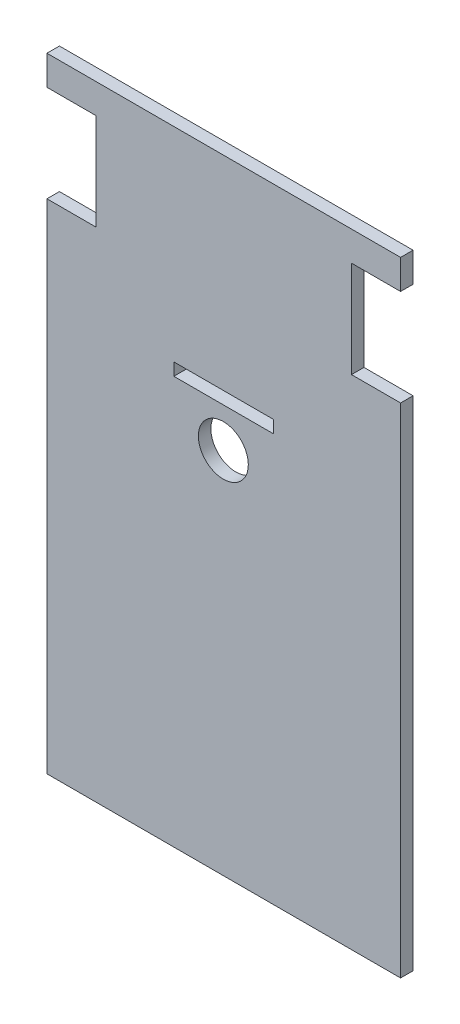
ISO-10303-21;
HEADER;
FILE_DESCRIPTION(('STEP AP214'),'2;1');
FILE_NAME('part.step','',(''),(''),'','','');
FILE_SCHEMA(('AUTOMOTIVE_DESIGN { 1 0 10303 214 1 1 1 1 }'));
ENDSEC;
DATA;
#1=APPLICATION_CONTEXT('core data for automotive mechanical design processes');
#2=APPLICATION_PROTOCOL_DEFINITION('international standard','automotive_design',2000,#1);
#3=PRODUCT_CONTEXT('',#1,'mechanical');
#4=PRODUCT('Part','Part','',(#3));
#5=PRODUCT_RELATED_PRODUCT_CATEGORY('part','',(#4));
#6=PRODUCT_DEFINITION_FORMATION('','',#4);
#7=PRODUCT_DEFINITION_CONTEXT('part definition',#1,'design');
#8=PRODUCT_DEFINITION('design','',#6,#7);
#9=PRODUCT_DEFINITION_SHAPE('','',#8);
#10=(LENGTH_UNIT() NAMED_UNIT(*) SI_UNIT(.MILLI.,.METRE.));
#11=(NAMED_UNIT(*) PLANE_ANGLE_UNIT() SI_UNIT($,.RADIAN.));
#12=(NAMED_UNIT(*) SI_UNIT($,.STERADIAN.) SOLID_ANGLE_UNIT());
#13=UNCERTAINTY_MEASURE_WITH_UNIT(LENGTH_MEASURE(1.E-05),#10,'distance_accuracy_value','');
#14=(GEOMETRIC_REPRESENTATION_CONTEXT(3) GLOBAL_UNCERTAINTY_ASSIGNED_CONTEXT((#13)) GLOBAL_UNIT_ASSIGNED_CONTEXT((#10,
#11,#12)) REPRESENTATION_CONTEXT('',''));
#15=CARTESIAN_POINT('',(0.,0.,0.));
#16=DIRECTION('',(0.,0.,1.));
#17=DIRECTION('',(1.,0.,0.));
#18=AXIS2_PLACEMENT_3D('',#15,#16,#17);
#19=CARTESIAN_POINT('',(0.,0.,3.));
#20=DIRECTION('',(0.,0.,1.));
#21=DIRECTION('',(1.,0.,0.));
#22=AXIS2_PLACEMENT_3D('',#19,#20,#21);
#23=PLANE('',#22);
#24=DIRECTION('',(-1.,0.,0.));
#25=VECTOR('',#24,1.);
#26=CARTESIAN_POINT('',(101.40298835968,92.60031120384,3.));
#27=LINE('',#26,#25);
#28=CARTESIAN_POINT('',(101.40298835968,92.60031120384,3.));
#29=VERTEX_POINT('',#28);
#30=CARTESIAN_POINT('',(16.4029883596799,92.60031120384,3.));
#31=VERTEX_POINT('',#30);
#32=EDGE_CURVE('E188',#29,#31,#27,.T.);
#33=ORIENTED_EDGE('',*,*,#32,.T.);
#34=DIRECTION('',(0.,-1.,0.));
#35=VECTOR('',#34,1.);
#36=CARTESIAN_POINT('',(16.4029883596799,92.60031120384,3.));
#37=LINE('',#36,#35);
#38=CARTESIAN_POINT('',(16.4029883596799,85.50031120384,3.));
#39=VERTEX_POINT('',#38);
#40=EDGE_CURVE('E191',#31,#39,#37,.T.);
#41=ORIENTED_EDGE('',*,*,#40,.T.);
#42=DIRECTION('',(1.,0.,0.));
#43=VECTOR('',#42,1.);
#44=CARTESIAN_POINT('',(16.4029883596799,85.50031120384,3.));
#45=LINE('',#44,#43);
#46=CARTESIAN_POINT('',(28.2029883596799,85.50031120384,3.));
#47=VERTEX_POINT('',#46);
#48=EDGE_CURVE('E194',#39,#47,#45,.T.);
#49=ORIENTED_EDGE('',*,*,#48,.T.);
#50=DIRECTION('',(0.,-1.,0.));
#51=VECTOR('',#50,1.);
#52=CARTESIAN_POINT('',(28.2029883596799,85.50031120384,3.));
#53=LINE('',#52,#51);
#54=CARTESIAN_POINT('',(28.2029883596799,62.30031120384,3.));
#55=VERTEX_POINT('',#54);
#56=EDGE_CURVE('E196',#47,#55,#53,.T.);
#57=ORIENTED_EDGE('',*,*,#56,.T.);
#58=DIRECTION('',(-1.,0.,0.));
#59=VECTOR('',#58,1.);
#60=CARTESIAN_POINT('',(28.2029883596799,62.30031120384,3.));
#61=LINE('',#60,#59);
#62=CARTESIAN_POINT('',(16.4029883596799,62.30031120384,3.));
#63=VERTEX_POINT('',#62);
#64=EDGE_CURVE('E198',#55,#63,#61,.T.);
#65=ORIENTED_EDGE('',*,*,#64,.T.);
#66=DIRECTION('',(0.,-1.,0.));
#67=VECTOR('',#66,1.);
#68=CARTESIAN_POINT('',(16.4029883596799,62.30031120384,3.));
#69=LINE('',#68,#67);
#70=CARTESIAN_POINT('',(16.4029883596799,-57.39968879616,3.));
#71=VERTEX_POINT('',#70);
#72=EDGE_CURVE('E200',#63,#71,#69,.T.);
#73=ORIENTED_EDGE('',*,*,#72,.T.);
#74=DIRECTION('',(1.,0.,0.));
#75=VECTOR('',#74,1.);
#76=CARTESIAN_POINT('',(16.4029883596799,-57.39968879616,3.));
#77=LINE('',#76,#75);
#78=CARTESIAN_POINT('',(101.40298835968,-57.39968879616,3.));
#79=VERTEX_POINT('',#78);
#80=EDGE_CURVE('E202',#71,#79,#77,.T.);
#81=ORIENTED_EDGE('',*,*,#80,.T.);
#82=DIRECTION('',(0.,1.,0.));
#83=VECTOR('',#82,1.);
#84=CARTESIAN_POINT('',(101.40298835968,-57.39968879616,3.));
#85=LINE('',#84,#83);
#86=CARTESIAN_POINT('',(101.40298835968,62.30031120384,3.));
#87=VERTEX_POINT('',#86);
#88=EDGE_CURVE('E204',#79,#87,#85,.T.);
#89=ORIENTED_EDGE('',*,*,#88,.T.);
#90=DIRECTION('',(-1.,0.,0.));
#91=VECTOR('',#90,1.);
#92=CARTESIAN_POINT('',(101.40298835968,62.30031120384,3.));
#93=LINE('',#92,#91);
#94=CARTESIAN_POINT('',(89.6029883596799,62.30031120384,3.));
#95=VERTEX_POINT('',#94);
#96=EDGE_CURVE('E206',#87,#95,#93,.T.);
#97=ORIENTED_EDGE('',*,*,#96,.T.);
#98=DIRECTION('',(0.,1.,0.));
#99=VECTOR('',#98,1.);
#100=CARTESIAN_POINT('',(89.6029883596799,62.30031120384,3.));
#101=LINE('',#100,#99);
#102=CARTESIAN_POINT('',(89.6029883596799,85.50031120384,3.));
#103=VERTEX_POINT('',#102);
#104=EDGE_CURVE('E208',#95,#103,#101,.T.);
#105=ORIENTED_EDGE('',*,*,#104,.T.);
#106=DIRECTION('',(1.,0.,0.));
#107=VECTOR('',#106,1.);
#108=CARTESIAN_POINT('',(89.6029883596799,85.50031120384,3.));
#109=LINE('',#108,#107);
#110=CARTESIAN_POINT('',(101.40298835968,85.5003112038398,3.));
#111=VERTEX_POINT('',#110);
#112=EDGE_CURVE('E210',#103,#111,#109,.T.);
#113=ORIENTED_EDGE('',*,*,#112,.T.);
#114=DIRECTION('',(0.,1.,0.));
#115=VECTOR('',#114,1.);
#116=CARTESIAN_POINT('',(101.40298835968,85.5003112038398,3.));
#117=LINE('',#116,#115);
#118=EDGE_CURVE('E212',#111,#29,#117,.T.);
#119=ORIENTED_EDGE('',*,*,#118,.T.);
#120=EDGE_LOOP('',(#33,#41,#49,#57,#65,#73,#81,#89,#97,#105,#113,#119));
#121=FACE_BOUND('',#120,.T.);
#122=CARTESIAN_POINT('',(58.8022925927055,31.129874196023,3.));
#123=DIRECTION('',(0.,0.,1.));
#124=DIRECTION('',(1.,0.,0.));
#125=AXIS2_PLACEMENT_3D('',#122,#123,#124);
#126=CIRCLE('',#125,6.00000000000001);
#127=CARTESIAN_POINT('',(64.8022925927055,31.129874196023,3.));
#128=VERTEX_POINT('',#127);
#129=EDGE_CURVE('E182',#128,#128,#126,.T.);
#130=ORIENTED_EDGE('',*,*,#129,.F.);
#131=EDGE_LOOP('',(#130));
#132=FACE_BOUND('',#131,.T.);
#133=DIRECTION('',(0.,1.,0.));
#134=VECTOR('',#133,1.);
#135=CARTESIAN_POINT('',(70.9029883596799,40.60031120384,3.));
#136=LINE('',#135,#134);
#137=CARTESIAN_POINT('',(70.9029883596799,40.60031120384,3.));
#138=VERTEX_POINT('',#137);
#139=CARTESIAN_POINT('',(70.9029883596799,43.60031120384,3.));
#140=VERTEX_POINT('',#139);
#141=EDGE_CURVE('E154',#138,#140,#136,.T.);
#142=ORIENTED_EDGE('',*,*,#141,.F.);
#143=DIRECTION('',(1.,0.,0.));
#144=VECTOR('',#143,1.);
#145=CARTESIAN_POINT('',(46.9029883596799,40.60031120384,3.));
#146=LINE('',#145,#144);
#147=CARTESIAN_POINT('',(46.9029883596799,40.60031120384,3.));
#148=VERTEX_POINT('',#147);
#149=EDGE_CURVE('E146',#148,#138,#146,.T.);
#150=ORIENTED_EDGE('',*,*,#149,.F.);
#151=DIRECTION('',(0.,-1.,0.));
#152=VECTOR('',#151,1.);
#153=CARTESIAN_POINT('',(46.9029883596799,43.60031120384,3.));
#154=LINE('',#153,#152);
#155=CARTESIAN_POINT('',(46.9029883596799,43.60031120384,3.));
#156=VERTEX_POINT('',#155);
#157=EDGE_CURVE('E168',#156,#148,#154,.T.);
#158=ORIENTED_EDGE('',*,*,#157,.F.);
#159=DIRECTION('',(-1.,0.,0.));
#160=VECTOR('',#159,1.);
#161=CARTESIAN_POINT('',(70.9029883596799,43.60031120384,3.));
#162=LINE('',#161,#160);
#163=EDGE_CURVE('E166',#140,#156,#162,.T.);
#164=ORIENTED_EDGE('',*,*,#163,.F.);
#165=EDGE_LOOP('',(#142,#150,#158,#164));
#166=FACE_BOUND('',#165,.T.);
#167=ADVANCED_FACE('F33',(#121,#132,#166),#23,.T.);
#168=CARTESIAN_POINT('',(0.,0.,0.));
#169=DIRECTION('',(0.,0.,1.));
#170=DIRECTION('',(1.,0.,0.));
#171=AXIS2_PLACEMENT_3D('',#168,#169,#170);
#172=PLANE('',#171);
#173=CARTESIAN_POINT('',(58.8022925927055,31.129874196023,0.));
#174=DIRECTION('',(0.,0.,1.));
#175=DIRECTION('',(1.,0.,0.));
#176=AXIS2_PLACEMENT_3D('',#173,#174,#175);
#177=CIRCLE('',#176,6.00000000000001);
#178=CARTESIAN_POINT('',(64.8022925927055,31.129874196023,0.));
#179=VERTEX_POINT('',#178);
#180=EDGE_CURVE('E162',#179,#179,#177,.T.);
#181=ORIENTED_EDGE('',*,*,#180,.T.);
#182=EDGE_LOOP('',(#181));
#183=FACE_BOUND('',#182,.T.);
#184=DIRECTION('',(-1.,0.,0.));
#185=VECTOR('',#184,1.);
#186=CARTESIAN_POINT('',(101.40298835968,92.60031120384,0.));
#187=LINE('',#186,#185);
#188=CARTESIAN_POINT('',(101.40298835968,92.60031120384,0.));
#189=VERTEX_POINT('',#188);
#190=CARTESIAN_POINT('',(16.4029883596799,92.60031120384,0.));
#191=VERTEX_POINT('',#190);
#192=EDGE_CURVE('E185',#189,#191,#187,.T.);
#193=ORIENTED_EDGE('',*,*,#192,.F.);
#194=DIRECTION('',(0.,1.,0.));
#195=VECTOR('',#194,1.);
#196=CARTESIAN_POINT('',(101.40298835968,85.5003112038398,0.));
#197=LINE('',#196,#195);
#198=CARTESIAN_POINT('',(101.40298835968,85.5003112038398,0.));
#199=VERTEX_POINT('',#198);
#200=EDGE_CURVE('E192',#199,#189,#197,.T.);
#201=ORIENTED_EDGE('',*,*,#200,.F.);
#202=DIRECTION('',(1.,0.,0.));
#203=VECTOR('',#202,1.);
#204=CARTESIAN_POINT('',(89.6029883596799,85.50031120384,0.));
#205=LINE('',#204,#203);
#206=CARTESIAN_POINT('',(89.6029883596799,85.50031120384,0.));
#207=VERTEX_POINT('',#206);
#208=EDGE_CURVE('E235',#207,#199,#205,.T.);
#209=ORIENTED_EDGE('',*,*,#208,.F.);
#210=DIRECTION('',(0.,1.,0.));
#211=VECTOR('',#210,1.);
#212=CARTESIAN_POINT('',(89.6029883596799,62.30031120384,0.));
#213=LINE('',#212,#211);
#214=CARTESIAN_POINT('',(89.6029883596799,62.30031120384,0.));
#215=VERTEX_POINT('',#214);
#216=EDGE_CURVE('E233',#215,#207,#213,.T.);
#217=ORIENTED_EDGE('',*,*,#216,.F.);
#218=DIRECTION('',(-1.,0.,0.));
#219=VECTOR('',#218,1.);
#220=CARTESIAN_POINT('',(101.40298835968,62.30031120384,0.));
#221=LINE('',#220,#219);
#222=CARTESIAN_POINT('',(101.40298835968,62.30031120384,0.));
#223=VERTEX_POINT('',#222);
#224=EDGE_CURVE('E231',#223,#215,#221,.T.);
#225=ORIENTED_EDGE('',*,*,#224,.F.);
#226=DIRECTION('',(0.,1.,0.));
#227=VECTOR('',#226,1.);
#228=CARTESIAN_POINT('',(101.40298835968,-57.39968879616,0.));
#229=LINE('',#228,#227);
#230=CARTESIAN_POINT('',(101.40298835968,-57.39968879616,0.));
#231=VERTEX_POINT('',#230);
#232=EDGE_CURVE('E229',#231,#223,#229,.T.);
#233=ORIENTED_EDGE('',*,*,#232,.F.);
#234=DIRECTION('',(1.,0.,0.));
#235=VECTOR('',#234,1.);
#236=CARTESIAN_POINT('',(16.4029883596799,-57.39968879616,0.));
#237=LINE('',#236,#235);
#238=CARTESIAN_POINT('',(16.4029883596799,-57.39968879616,0.));
#239=VERTEX_POINT('',#238);
#240=EDGE_CURVE('E227',#239,#231,#237,.T.);
#241=ORIENTED_EDGE('',*,*,#240,.F.);
#242=DIRECTION('',(0.,-1.,0.));
#243=VECTOR('',#242,1.);
#244=CARTESIAN_POINT('',(16.4029883596799,62.30031120384,0.));
#245=LINE('',#244,#243);
#246=CARTESIAN_POINT('',(16.4029883596799,62.30031120384,0.));
#247=VERTEX_POINT('',#246);
#248=EDGE_CURVE('E225',#247,#239,#245,.T.);
#249=ORIENTED_EDGE('',*,*,#248,.F.);
#250=DIRECTION('',(-1.,0.,0.));
#251=VECTOR('',#250,1.);
#252=CARTESIAN_POINT('',(28.2029883596799,62.30031120384,0.));
#253=LINE('',#252,#251);
#254=CARTESIAN_POINT('',(28.2029883596799,62.30031120384,0.));
#255=VERTEX_POINT('',#254);
#256=EDGE_CURVE('E223',#255,#247,#253,.T.);
#257=ORIENTED_EDGE('',*,*,#256,.F.);
#258=DIRECTION('',(0.,-1.,0.));
#259=VECTOR('',#258,1.);
#260=CARTESIAN_POINT('',(28.2029883596799,85.50031120384,0.));
#261=LINE('',#260,#259);
#262=CARTESIAN_POINT('',(28.2029883596799,85.50031120384,0.));
#263=VERTEX_POINT('',#262);
#264=EDGE_CURVE('E221',#263,#255,#261,.T.);
#265=ORIENTED_EDGE('',*,*,#264,.F.);
#266=DIRECTION('',(1.,0.,0.));
#267=VECTOR('',#266,1.);
#268=CARTESIAN_POINT('',(16.4029883596799,85.50031120384,0.));
#269=LINE('',#268,#267);
#270=CARTESIAN_POINT('',(16.4029883596799,85.50031120384,0.));
#271=VERTEX_POINT('',#270);
#272=EDGE_CURVE('E219',#271,#263,#269,.T.);
#273=ORIENTED_EDGE('',*,*,#272,.F.);
#274=DIRECTION('',(0.,-1.,0.));
#275=VECTOR('',#274,1.);
#276=CARTESIAN_POINT('',(16.4029883596799,92.60031120384,0.));
#277=LINE('',#276,#275);
#278=EDGE_CURVE('E217',#191,#271,#277,.T.);
#279=ORIENTED_EDGE('',*,*,#278,.F.);
#280=EDGE_LOOP('',(#193,#201,#209,#217,#225,#233,#241,#249,#257,#265,#273,#279));
#281=FACE_BOUND('',#280,.T.);
#282=DIRECTION('',(1.,0.,0.));
#283=VECTOR('',#282,1.);
#284=CARTESIAN_POINT('',(46.9029883596799,40.60031120384,0.));
#285=LINE('',#284,#283);
#286=CARTESIAN_POINT('',(46.9029883596799,40.60031120384,0.));
#287=VERTEX_POINT('',#286);
#288=CARTESIAN_POINT('',(70.9029883596799,40.60031120384,0.));
#289=VERTEX_POINT('',#288);
#290=EDGE_CURVE('E56',#287,#289,#285,.T.);
#291=ORIENTED_EDGE('',*,*,#290,.T.);
#292=DIRECTION('',(0.,1.,0.));
#293=VECTOR('',#292,1.);
#294=CARTESIAN_POINT('',(70.9029883596799,40.60031120384,0.));
#295=LINE('',#294,#293);
#296=CARTESIAN_POINT('',(70.9029883596799,43.60031120384,0.));
#297=VERTEX_POINT('',#296);
#298=EDGE_CURVE('E161',#289,#297,#295,.T.);
#299=ORIENTED_EDGE('',*,*,#298,.T.);
#300=DIRECTION('',(-1.,0.,0.));
#301=VECTOR('',#300,1.);
#302=CARTESIAN_POINT('',(70.9029883596799,43.60031120384,0.));
#303=LINE('',#302,#301);
#304=CARTESIAN_POINT('',(46.9029883596799,43.60031120384,0.));
#305=VERTEX_POINT('',#304);
#306=EDGE_CURVE('E174',#297,#305,#303,.T.);
#307=ORIENTED_EDGE('',*,*,#306,.T.);
#308=DIRECTION('',(0.,-1.,0.));
#309=VECTOR('',#308,1.);
#310=CARTESIAN_POINT('',(46.9029883596799,43.60031120384,0.));
#311=LINE('',#310,#309);
#312=EDGE_CURVE('E155',#305,#287,#311,.T.);
#313=ORIENTED_EDGE('',*,*,#312,.T.);
#314=EDGE_LOOP('',(#291,#299,#307,#313));
#315=FACE_BOUND('',#314,.T.);
#316=ADVANCED_FACE('F277',(#183,#281,#315),#172,.F.);
#317=CARTESIAN_POINT('',(101.40298835968,92.60031120384,3.));
#318=DIRECTION('',(0.,-1.,0.));
#319=DIRECTION('',(0.,0.,-1.));
#320=AXIS2_PLACEMENT_3D('',#317,#318,#319);
#321=PLANE('',#320);
#322=ORIENTED_EDGE('',*,*,#192,.T.);
#323=DIRECTION('',(0.,0.,-1.));
#324=VECTOR('',#323,1.);
#325=CARTESIAN_POINT('',(16.4029883596799,92.60031120384,3.));
#326=LINE('',#325,#324);
#327=EDGE_CURVE('E11',#31,#191,#326,.T.);
#328=ORIENTED_EDGE('',*,*,#327,.F.);
#329=ORIENTED_EDGE('',*,*,#32,.F.);
#330=DIRECTION('',(0.,0.,-1.));
#331=VECTOR('',#330,1.);
#332=CARTESIAN_POINT('',(101.40298835968,92.60031120384,3.));
#333=LINE('',#332,#331);
#334=EDGE_CURVE('E214',#29,#189,#333,.T.);
#335=ORIENTED_EDGE('',*,*,#334,.T.);
#336=EDGE_LOOP('',(#322,#328,#329,#335));
#337=FACE_BOUND('',#336,.T.);
#338=ADVANCED_FACE('F35',(#337),#321,.F.);
#339=CARTESIAN_POINT('',(16.4029883596799,92.60031120384,3.));
#340=DIRECTION('',(1.,0.,0.));
#341=DIRECTION('',(0.,0.,-1.));
#342=AXIS2_PLACEMENT_3D('',#339,#340,#341);
#343=PLANE('',#342);
#344=ORIENTED_EDGE('',*,*,#278,.T.);
#345=DIRECTION('',(0.,0.,-1.));
#346=VECTOR('',#345,1.);
#347=CARTESIAN_POINT('',(16.4029883596799,85.50031120384,3.));
#348=LINE('',#347,#346);
#349=EDGE_CURVE('E41',#39,#271,#348,.T.);
#350=ORIENTED_EDGE('',*,*,#349,.F.);
#351=ORIENTED_EDGE('',*,*,#40,.F.);
#352=ORIENTED_EDGE('',*,*,#327,.T.);
#353=EDGE_LOOP('',(#344,#350,#351,#352));
#354=FACE_BOUND('',#353,.T.);
#355=ADVANCED_FACE('F295',(#354),#343,.F.);
#356=CARTESIAN_POINT('',(16.4029883596799,85.50031120384,3.));
#357=DIRECTION('',(0.,1.,0.));
#358=DIRECTION('',(0.,0.,1.));
#359=AXIS2_PLACEMENT_3D('',#356,#357,#358);
#360=PLANE('',#359);
#361=ORIENTED_EDGE('',*,*,#272,.T.);
#362=DIRECTION('',(0.,0.,-1.));
#363=VECTOR('',#362,1.);
#364=CARTESIAN_POINT('',(28.2029883596799,85.50031120384,3.));
#365=LINE('',#364,#363);
#366=EDGE_CURVE('E264',#47,#263,#365,.T.);
#367=ORIENTED_EDGE('',*,*,#366,.F.);
#368=ORIENTED_EDGE('',*,*,#48,.F.);
#369=ORIENTED_EDGE('',*,*,#349,.T.);
#370=EDGE_LOOP('',(#361,#367,#368,#369));
#371=FACE_BOUND('',#370,.T.);
#372=ADVANCED_FACE('F271',(#371),#360,.F.);
#373=CARTESIAN_POINT('',(28.2029883596799,85.50031120384,3.));
#374=DIRECTION('',(1.,0.,0.));
#375=DIRECTION('',(0.,0.,-1.));
#376=AXIS2_PLACEMENT_3D('',#373,#374,#375);
#377=PLANE('',#376);
#378=ORIENTED_EDGE('',*,*,#264,.T.);
#379=DIRECTION('',(0.,0.,-1.));
#380=VECTOR('',#379,1.);
#381=CARTESIAN_POINT('',(28.2029883596799,62.30031120384,3.));
#382=LINE('',#381,#380);
#383=EDGE_CURVE('E261',#55,#255,#382,.T.);
#384=ORIENTED_EDGE('',*,*,#383,.F.);
#385=ORIENTED_EDGE('',*,*,#56,.F.);
#386=ORIENTED_EDGE('',*,*,#366,.T.);
#387=EDGE_LOOP('',(#378,#384,#385,#386));
#388=FACE_BOUND('',#387,.T.);
#389=ADVANCED_FACE('F283',(#388),#377,.F.);
#390=CARTESIAN_POINT('',(28.2029883596799,62.30031120384,3.));
#391=DIRECTION('',(0.,-1.,0.));
#392=DIRECTION('',(0.,0.,-1.));
#393=AXIS2_PLACEMENT_3D('',#390,#391,#392);
#394=PLANE('',#393);
#395=ORIENTED_EDGE('',*,*,#256,.T.);
#396=DIRECTION('',(0.,0.,-1.));
#397=VECTOR('',#396,1.);
#398=CARTESIAN_POINT('',(16.4029883596799,62.30031120384,3.));
#399=LINE('',#398,#397);
#400=EDGE_CURVE('E258',#63,#247,#399,.T.);
#401=ORIENTED_EDGE('',*,*,#400,.F.);
#402=ORIENTED_EDGE('',*,*,#64,.F.);
#403=ORIENTED_EDGE('',*,*,#383,.T.);
#404=EDGE_LOOP('',(#395,#401,#402,#403));
#405=FACE_BOUND('',#404,.T.);
#406=ADVANCED_FACE('F287',(#405),#394,.F.);
#407=CARTESIAN_POINT('',(16.4029883596799,62.30031120384,3.));
#408=DIRECTION('',(1.,0.,0.));
#409=DIRECTION('',(0.,0.,-1.));
#410=AXIS2_PLACEMENT_3D('',#407,#408,#409);
#411=PLANE('',#410);
#412=ORIENTED_EDGE('',*,*,#248,.T.);
#413=DIRECTION('',(0.,0.,-1.));
#414=VECTOR('',#413,1.);
#415=CARTESIAN_POINT('',(16.4029883596799,-57.39968879616,3.));
#416=LINE('',#415,#414);
#417=EDGE_CURVE('E255',#71,#239,#416,.T.);
#418=ORIENTED_EDGE('',*,*,#417,.F.);
#419=ORIENTED_EDGE('',*,*,#72,.F.);
#420=ORIENTED_EDGE('',*,*,#400,.T.);
#421=EDGE_LOOP('',(#412,#418,#419,#420));
#422=FACE_BOUND('',#421,.T.);
#423=ADVANCED_FACE('F328',(#422),#411,.F.);
#424=CARTESIAN_POINT('',(16.4029883596799,-57.39968879616,3.));
#425=DIRECTION('',(0.,1.,0.));
#426=DIRECTION('',(0.,0.,1.));
#427=AXIS2_PLACEMENT_3D('',#424,#425,#426);
#428=PLANE('',#427);
#429=ORIENTED_EDGE('',*,*,#240,.T.);
#430=DIRECTION('',(0.,0.,-1.));
#431=VECTOR('',#430,1.);
#432=CARTESIAN_POINT('',(101.40298835968,-57.39968879616,3.));
#433=LINE('',#432,#431);
#434=EDGE_CURVE('E252',#79,#231,#433,.T.);
#435=ORIENTED_EDGE('',*,*,#434,.F.);
#436=ORIENTED_EDGE('',*,*,#80,.F.);
#437=ORIENTED_EDGE('',*,*,#417,.T.);
#438=EDGE_LOOP('',(#429,#435,#436,#437));
#439=FACE_BOUND('',#438,.T.);
#440=ADVANCED_FACE('F326',(#439),#428,.F.);
#441=CARTESIAN_POINT('',(101.40298835968,-57.39968879616,3.));
#442=DIRECTION('',(-1.,0.,0.));
#443=DIRECTION('',(0.,0.,1.));
#444=AXIS2_PLACEMENT_3D('',#441,#442,#443);
#445=PLANE('',#444);
#446=ORIENTED_EDGE('',*,*,#232,.T.);
#447=DIRECTION('',(0.,0.,-1.));
#448=VECTOR('',#447,1.);
#449=CARTESIAN_POINT('',(101.40298835968,62.30031120384,3.));
#450=LINE('',#449,#448);
#451=EDGE_CURVE('E249',#87,#223,#450,.T.);
#452=ORIENTED_EDGE('',*,*,#451,.F.);
#453=ORIENTED_EDGE('',*,*,#88,.F.);
#454=ORIENTED_EDGE('',*,*,#434,.T.);
#455=EDGE_LOOP('',(#446,#452,#453,#454));
#456=FACE_BOUND('',#455,.T.);
#457=ADVANCED_FACE('F322',(#456),#445,.F.);
#458=CARTESIAN_POINT('',(101.40298835968,62.30031120384,3.));
#459=DIRECTION('',(0.,-1.,0.));
#460=DIRECTION('',(0.,0.,-1.));
#461=AXIS2_PLACEMENT_3D('',#458,#459,#460);
#462=PLANE('',#461);
#463=ORIENTED_EDGE('',*,*,#224,.T.);
#464=DIRECTION('',(0.,0.,-1.));
#465=VECTOR('',#464,1.);
#466=CARTESIAN_POINT('',(89.6029883596799,62.30031120384,3.));
#467=LINE('',#466,#465);
#468=EDGE_CURVE('E246',#95,#215,#467,.T.);
#469=ORIENTED_EDGE('',*,*,#468,.F.);
#470=ORIENTED_EDGE('',*,*,#96,.F.);
#471=ORIENTED_EDGE('',*,*,#451,.T.);
#472=EDGE_LOOP('',(#463,#469,#470,#471));
#473=FACE_BOUND('',#472,.T.);
#474=ADVANCED_FACE('F317',(#473),#462,.F.);
#475=CARTESIAN_POINT('',(89.6029883596799,62.30031120384,3.));
#476=DIRECTION('',(-1.,0.,0.));
#477=DIRECTION('',(0.,0.,1.));
#478=AXIS2_PLACEMENT_3D('',#475,#476,#477);
#479=PLANE('',#478);
#480=ORIENTED_EDGE('',*,*,#216,.T.);
#481=DIRECTION('',(0.,0.,-1.));
#482=VECTOR('',#481,1.);
#483=CARTESIAN_POINT('',(89.6029883596799,85.50031120384,3.));
#484=LINE('',#483,#482);
#485=EDGE_CURVE('E243',#103,#207,#484,.T.);
#486=ORIENTED_EDGE('',*,*,#485,.F.);
#487=ORIENTED_EDGE('',*,*,#104,.F.);
#488=ORIENTED_EDGE('',*,*,#468,.T.);
#489=EDGE_LOOP('',(#480,#486,#487,#488));
#490=FACE_BOUND('',#489,.T.);
#491=ADVANCED_FACE('F311',(#490),#479,.F.);
#492=CARTESIAN_POINT('',(89.6029883596799,85.50031120384,3.));
#493=DIRECTION('',(0.,1.,0.));
#494=DIRECTION('',(-1.,0.,0.));
#495=AXIS2_PLACEMENT_3D('',#492,#493,#494);
#496=PLANE('',#495);
#497=ORIENTED_EDGE('',*,*,#208,.T.);
#498=DIRECTION('',(0.,0.,-1.));
#499=VECTOR('',#498,1.);
#500=CARTESIAN_POINT('',(101.40298835968,85.5003112038398,3.));
#501=LINE('',#500,#499);
#502=EDGE_CURVE('E240',#111,#199,#501,.T.);
#503=ORIENTED_EDGE('',*,*,#502,.F.);
#504=ORIENTED_EDGE('',*,*,#112,.F.);
#505=ORIENTED_EDGE('',*,*,#485,.T.);
#506=EDGE_LOOP('',(#497,#503,#504,#505));
#507=FACE_BOUND('',#506,.T.);
#508=ADVANCED_FACE('F307',(#507),#496,.F.);
#509=CARTESIAN_POINT('',(101.40298835968,85.5003112038398,3.));
#510=DIRECTION('',(-1.,0.,0.));
#511=DIRECTION('',(0.,0.,1.));
#512=AXIS2_PLACEMENT_3D('',#509,#510,#511);
#513=PLANE('',#512);
#514=ORIENTED_EDGE('',*,*,#200,.T.);
#515=ORIENTED_EDGE('',*,*,#334,.F.);
#516=ORIENTED_EDGE('',*,*,#118,.F.);
#517=ORIENTED_EDGE('',*,*,#502,.T.);
#518=EDGE_LOOP('',(#514,#515,#516,#517));
#519=FACE_BOUND('',#518,.T.);
#520=ADVANCED_FACE('F302',(#519),#513,.F.);
#521=CARTESIAN_POINT('',(58.8022925927055,31.129874196023,3.));
#522=DIRECTION('',(0.,0.,-1.));
#523=DIRECTION('',(-1.,0.,0.));
#524=AXIS2_PLACEMENT_3D('',#521,#522,#523);
#525=CYLINDRICAL_SURFACE('',#524,6.00000000000001);
#526=ORIENTED_EDGE('',*,*,#129,.T.);
#527=EDGE_LOOP('',(#526));
#528=FACE_BOUND('',#527,.T.);
#529=ORIENTED_EDGE('',*,*,#180,.F.);
#530=EDGE_LOOP('',(#529));
#531=FACE_BOUND('',#530,.T.);
#532=ADVANCED_FACE('F345',(#528,#531),#525,.F.);
#533=CARTESIAN_POINT('',(46.9029883596799,40.60031120384,3.));
#534=DIRECTION('',(0.,1.,0.));
#535=DIRECTION('',(0.,0.,1.));
#536=AXIS2_PLACEMENT_3D('',#533,#534,#535);
#537=PLANE('',#536);
#538=ORIENTED_EDGE('',*,*,#290,.F.);
#539=DIRECTION('',(0.,0.,-1.));
#540=VECTOR('',#539,1.);
#541=CARTESIAN_POINT('',(46.9029883596799,40.60031120384,3.));
#542=LINE('',#541,#540);
#543=EDGE_CURVE('E150',#148,#287,#542,.T.);
#544=ORIENTED_EDGE('',*,*,#543,.F.);
#545=ORIENTED_EDGE('',*,*,#149,.T.);
#546=DIRECTION('',(0.,0.,-1.));
#547=VECTOR('',#546,1.);
#548=CARTESIAN_POINT('',(70.9029883596799,40.60031120384,3.));
#549=LINE('',#548,#547);
#550=EDGE_CURVE('E149',#138,#289,#549,.T.);
#551=ORIENTED_EDGE('',*,*,#550,.T.);
#552=EDGE_LOOP('',(#538,#544,#545,#551));
#553=FACE_BOUND('',#552,.T.);
#554=ADVANCED_FACE('F148',(#553),#537,.T.);
#555=CARTESIAN_POINT('',(70.9029883596799,40.60031120384,3.));
#556=DIRECTION('',(-1.,0.,0.));
#557=DIRECTION('',(0.,0.,1.));
#558=AXIS2_PLACEMENT_3D('',#555,#556,#557);
#559=PLANE('',#558);
#560=ORIENTED_EDGE('',*,*,#298,.F.);
#561=ORIENTED_EDGE('',*,*,#550,.F.);
#562=ORIENTED_EDGE('',*,*,#141,.T.);
#563=DIRECTION('',(0.,0.,-1.));
#564=VECTOR('',#563,1.);
#565=CARTESIAN_POINT('',(70.9029883596799,43.60031120384,3.));
#566=LINE('',#565,#564);
#567=EDGE_CURVE('E163',#140,#297,#566,.T.);
#568=ORIENTED_EDGE('',*,*,#567,.T.);
#569=EDGE_LOOP('',(#560,#561,#562,#568));
#570=FACE_BOUND('',#569,.T.);
#571=ADVANCED_FACE('F158',(#570),#559,.T.);
#572=CARTESIAN_POINT('',(70.9029883596799,43.60031120384,3.));
#573=DIRECTION('',(0.,-1.,0.));
#574=DIRECTION('',(0.,0.,-1.));
#575=AXIS2_PLACEMENT_3D('',#572,#573,#574);
#576=PLANE('',#575);
#577=ORIENTED_EDGE('',*,*,#306,.F.);
#578=ORIENTED_EDGE('',*,*,#567,.F.);
#579=ORIENTED_EDGE('',*,*,#163,.T.);
#580=DIRECTION('',(0.,0.,-1.));
#581=VECTOR('',#580,1.);
#582=CARTESIAN_POINT('',(46.9029883596799,43.60031120384,3.));
#583=LINE('',#582,#581);
#584=EDGE_CURVE('E48',#156,#305,#583,.T.);
#585=ORIENTED_EDGE('',*,*,#584,.T.);
#586=EDGE_LOOP('',(#577,#578,#579,#585));
#587=FACE_BOUND('',#586,.T.);
#588=ADVANCED_FACE('F394',(#587),#576,.T.);
#589=CARTESIAN_POINT('',(46.9029883596799,43.60031120384,3.));
#590=DIRECTION('',(1.,0.,0.));
#591=DIRECTION('',(0.,1.,0.));
#592=AXIS2_PLACEMENT_3D('',#589,#590,#591);
#593=PLANE('',#592);
#594=ORIENTED_EDGE('',*,*,#312,.F.);
#595=ORIENTED_EDGE('',*,*,#584,.F.);
#596=ORIENTED_EDGE('',*,*,#157,.T.);
#597=ORIENTED_EDGE('',*,*,#543,.T.);
#598=EDGE_LOOP('',(#594,#595,#596,#597));
#599=FACE_BOUND('',#598,.T.);
#600=ADVANCED_FACE('F401',(#599),#593,.T.);
#601=CLOSED_SHELL('',(#167,#316,#338,#355,#372,#389,#406,#423,#440,#457,#474,#491,#508,#520,
#532,#554,#571,#588,#600));
#602=MANIFOLD_SOLID_BREP('B2',#601);
#603=ADVANCED_BREP_SHAPE_REPRESENTATION('',(#18,#602),#14);
#604=SHAPE_DEFINITION_REPRESENTATION(#9,#603);
ENDSEC;
END-ISO-10303-21;
